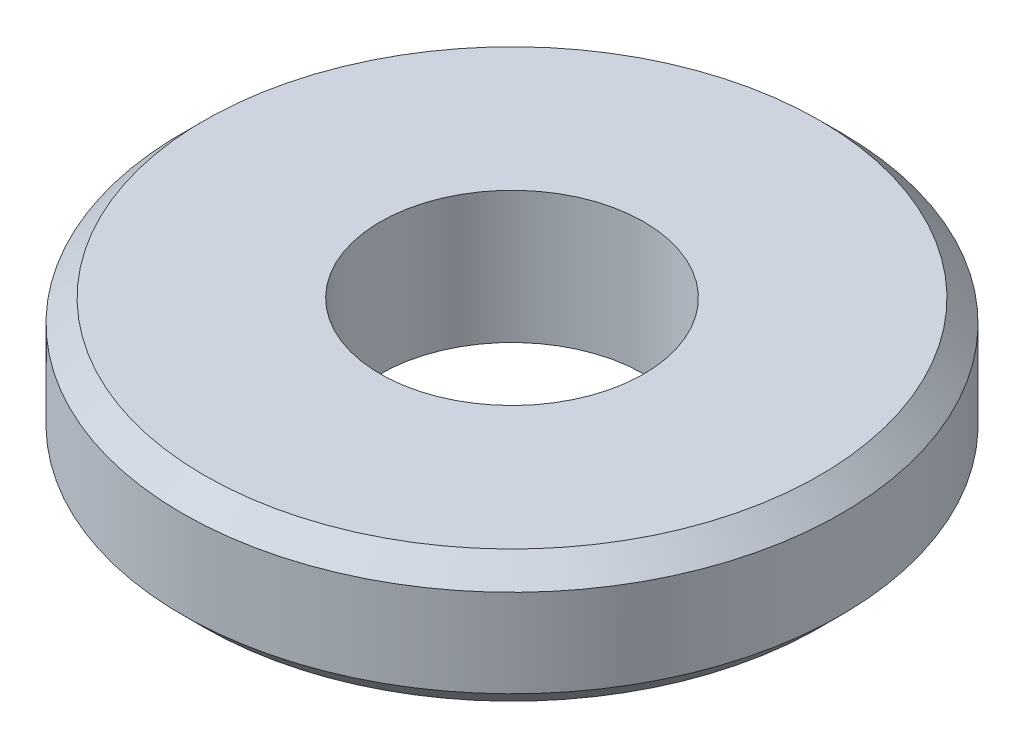
ISO-10303-21;
HEADER;
FILE_DESCRIPTION(('STEP AP214'),'2;1');
FILE_NAME('part.step','',(''),(''),'','','');
FILE_SCHEMA(('AUTOMOTIVE_DESIGN { 1 0 10303 214 1 1 1 1 }'));
ENDSEC;
DATA;
#1=APPLICATION_CONTEXT('core data for automotive mechanical design processes');
#2=APPLICATION_PROTOCOL_DEFINITION('international standard','automotive_design',2000,#1);
#3=PRODUCT_CONTEXT('',#1,'mechanical');
#4=PRODUCT('Part','Part','',(#3));
#5=PRODUCT_RELATED_PRODUCT_CATEGORY('part','',(#4));
#6=PRODUCT_DEFINITION_FORMATION('','',#4);
#7=PRODUCT_DEFINITION_CONTEXT('part definition',#1,'design');
#8=PRODUCT_DEFINITION('design','',#6,#7);
#9=PRODUCT_DEFINITION_SHAPE('','',#8);
#10=(LENGTH_UNIT() NAMED_UNIT(*) SI_UNIT(.MILLI.,.METRE.));
#11=(NAMED_UNIT(*) PLANE_ANGLE_UNIT() SI_UNIT($,.RADIAN.));
#12=(NAMED_UNIT(*) SI_UNIT($,.STERADIAN.) SOLID_ANGLE_UNIT());
#13=UNCERTAINTY_MEASURE_WITH_UNIT(LENGTH_MEASURE(1.E-05),#10,'distance_accuracy_value','');
#14=(GEOMETRIC_REPRESENTATION_CONTEXT(3) GLOBAL_UNCERTAINTY_ASSIGNED_CONTEXT((#13)) GLOBAL_UNIT_ASSIGNED_CONTEXT((#10,
#11,#12)) REPRESENTATION_CONTEXT('',''));
#15=CARTESIAN_POINT('',(0.,0.,0.));
#16=DIRECTION('',(0.,0.,1.));
#17=DIRECTION('',(1.,0.,0.));
#18=AXIS2_PLACEMENT_3D('',#15,#16,#17);
#19=CARTESIAN_POINT('',(15.,0.,0.));
#20=DIRECTION('',(0.,-1.,0.));
#21=DIRECTION('',(0.,0.,-1.));
#22=AXIS2_PLACEMENT_3D('',#19,#20,#21);
#23=PLANE('',#22);
#24=CARTESIAN_POINT('',(0.,0.,0.));
#25=DIRECTION('',(0.,-1.,0.));
#26=DIRECTION('',(0.,0.,-1.));
#27=AXIS2_PLACEMENT_3D('',#24,#25,#26);
#28=CIRCLE('',#27,14.);
#29=CARTESIAN_POINT('',(0.,0.,-14.));
#30=VERTEX_POINT('',#29);
#31=EDGE_CURVE('E57',#30,#30,#28,.T.);
#32=ORIENTED_EDGE('',*,*,#31,.T.);
#33=EDGE_LOOP('',(#32));
#34=FACE_BOUND('',#33,.T.);
#35=CARTESIAN_POINT('',(0.,0.,0.));
#36=DIRECTION('',(0.,-1.,0.));
#37=DIRECTION('',(0.,0.,-1.));
#38=AXIS2_PLACEMENT_3D('',#35,#36,#37);
#39=CIRCLE('',#38,6.);
#40=CARTESIAN_POINT('',(0.,0.,-6.));
#41=VERTEX_POINT('',#40);
#42=EDGE_CURVE('E63',#41,#41,#39,.T.);
#43=ORIENTED_EDGE('',*,*,#42,.F.);
#44=EDGE_LOOP('',(#43));
#45=FACE_BOUND('',#44,.T.);
#46=ADVANCED_FACE('F38',(#34,#45),#23,.T.);
#47=CARTESIAN_POINT('',(0.,0.,0.));
#48=DIRECTION('',(0.,-1.,0.));
#49=DIRECTION('',(0.,0.,-1.));
#50=AXIS2_PLACEMENT_3D('',#47,#48,#49);
#51=CYLINDRICAL_SURFACE('',#50,6.);
#52=ORIENTED_EDGE('',*,*,#42,.T.);
#53=EDGE_LOOP('',(#52));
#54=FACE_BOUND('',#53,.T.);
#55=CARTESIAN_POINT('',(0.,6.,0.));
#56=DIRECTION('',(0.,-1.,0.));
#57=DIRECTION('',(0.,0.,-1.));
#58=AXIS2_PLACEMENT_3D('',#55,#56,#57);
#59=CIRCLE('',#58,6.);
#60=CARTESIAN_POINT('',(0.,6.,-6.));
#61=VERTEX_POINT('',#60);
#62=EDGE_CURVE('E67',#61,#61,#59,.T.);
#63=ORIENTED_EDGE('',*,*,#62,.F.);
#64=EDGE_LOOP('',(#63));
#65=FACE_BOUND('',#64,.T.);
#66=ADVANCED_FACE('F74',(#54,#65),#51,.F.);
#67=CARTESIAN_POINT('',(6.,6.,0.));
#68=DIRECTION('',(0.,1.,0.));
#69=DIRECTION('',(0.,0.,1.));
#70=AXIS2_PLACEMENT_3D('',#67,#68,#69);
#71=PLANE('',#70);
#72=CARTESIAN_POINT('',(0.,6.,0.));
#73=DIRECTION('',(0.,1.,0.));
#74=DIRECTION('',(0.,0.,1.));
#75=AXIS2_PLACEMENT_3D('',#72,#73,#74);
#76=CIRCLE('',#75,14.);
#77=CARTESIAN_POINT('',(0.,6.,14.));
#78=VERTEX_POINT('',#77);
#79=EDGE_CURVE('E10',#78,#78,#76,.T.);
#80=ORIENTED_EDGE('',*,*,#79,.T.);
#81=EDGE_LOOP('',(#80));
#82=FACE_BOUND('',#81,.T.);
#83=ORIENTED_EDGE('',*,*,#62,.T.);
#84=EDGE_LOOP('',(#83));
#85=FACE_BOUND('',#84,.T.);
#86=ADVANCED_FACE('F72',(#82,#85),#71,.T.);
#87=CARTESIAN_POINT('',(0.,0.,0.));
#88=DIRECTION('',(0.,-1.,0.));
#89=DIRECTION('',(0.,0.,-1.));
#90=AXIS2_PLACEMENT_3D('',#87,#88,#89);
#91=CYLINDRICAL_SURFACE('',#90,15.);
#92=CARTESIAN_POINT('',(0.,1.00000000000001,0.));
#93=DIRECTION('',(0.,-1.,0.));
#94=DIRECTION('',(0.,0.,-1.));
#95=AXIS2_PLACEMENT_3D('',#92,#93,#94);
#96=CIRCLE('',#95,15.);
#97=CARTESIAN_POINT('',(0.,1.00000000000001,-15.));
#98=VERTEX_POINT('',#97);
#99=EDGE_CURVE('E47',#98,#98,#96,.F.);
#100=ORIENTED_EDGE('',*,*,#99,.T.);
#101=EDGE_LOOP('',(#100));
#102=FACE_BOUND('',#101,.T.);
#103=CARTESIAN_POINT('',(0.,5.,0.));
#104=DIRECTION('',(0.,1.,0.));
#105=DIRECTION('',(0.,0.,1.));
#106=AXIS2_PLACEMENT_3D('',#103,#104,#105);
#107=CIRCLE('',#106,15.);
#108=CARTESIAN_POINT('',(0.,5.,15.));
#109=VERTEX_POINT('',#108);
#110=EDGE_CURVE('E52',#109,#109,#107,.F.);
#111=ORIENTED_EDGE('',*,*,#110,.T.);
#112=EDGE_LOOP('',(#111));
#113=FACE_BOUND('',#112,.T.);
#114=ADVANCED_FACE('F83',(#102,#113),#91,.T.);
#115=CARTESIAN_POINT('',(0.,0.,0.));
#116=DIRECTION('',(0.,1.,0.));
#117=DIRECTION('',(0.,0.,1.));
#118=AXIS2_PLACEMENT_3D('',#115,#116,#117);
#119=CONICAL_SURFACE('',#118,14.,0.785398163397447);
#120=ORIENTED_EDGE('',*,*,#99,.F.);
#121=EDGE_LOOP('',(#120));
#122=FACE_BOUND('',#121,.T.);
#123=ORIENTED_EDGE('',*,*,#31,.F.);
#124=EDGE_LOOP('',(#123));
#125=FACE_BOUND('',#124,.T.);
#126=ADVANCED_FACE('F90',(#122,#125),#119,.T.);
#127=CARTESIAN_POINT('',(0.,5.,0.));
#128=DIRECTION('',(0.,-1.,0.));
#129=DIRECTION('',(0.,0.,-1.));
#130=AXIS2_PLACEMENT_3D('',#127,#128,#129);
#131=CONICAL_SURFACE('',#130,15.,0.78539816339745);
#132=ORIENTED_EDGE('',*,*,#79,.F.);
#133=EDGE_LOOP('',(#132));
#134=FACE_BOUND('',#133,.T.);
#135=ORIENTED_EDGE('',*,*,#110,.F.);
#136=EDGE_LOOP('',(#135));
#137=FACE_BOUND('',#136,.T.);
#138=ADVANCED_FACE('F41',(#134,#137),#131,.T.);
#139=CLOSED_SHELL('',(#46,#66,#86,#114,#126,#138));
#140=MANIFOLD_SOLID_BREP('B2',#139);
#141=ADVANCED_BREP_SHAPE_REPRESENTATION('',(#18,#140),#14);
#142=SHAPE_DEFINITION_REPRESENTATION(#9,#141);
ENDSEC;
END-ISO-10303-21;
